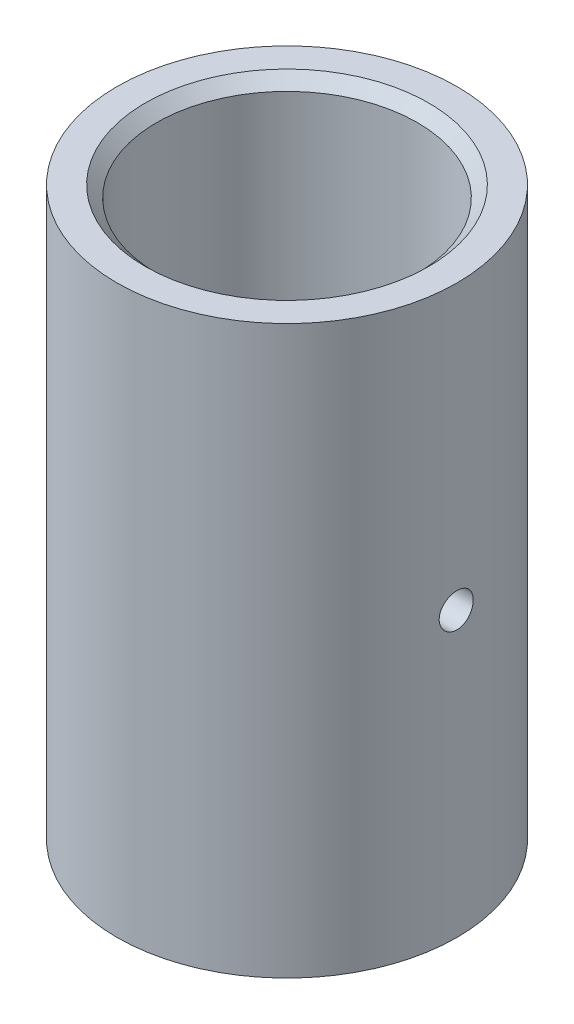
ISO-10303-21;
HEADER;
FILE_DESCRIPTION(('STEP AP214'),'2;1');
FILE_NAME('part.step','',(''),(''),'','','');
FILE_SCHEMA(('AUTOMOTIVE_DESIGN { 1 0 10303 214 1 1 1 1 }'));
ENDSEC;
DATA;
#1=APPLICATION_CONTEXT('core data for automotive mechanical design processes');
#2=APPLICATION_PROTOCOL_DEFINITION('international standard','automotive_design',2000,#1);
#3=PRODUCT_CONTEXT('',#1,'mechanical');
#4=PRODUCT('Part','Part','',(#3));
#5=PRODUCT_RELATED_PRODUCT_CATEGORY('part','',(#4));
#6=PRODUCT_DEFINITION_FORMATION('','',#4);
#7=PRODUCT_DEFINITION_CONTEXT('part definition',#1,'design');
#8=PRODUCT_DEFINITION('design','',#6,#7);
#9=PRODUCT_DEFINITION_SHAPE('','',#8);
#10=(LENGTH_UNIT() NAMED_UNIT(*) SI_UNIT(.MILLI.,.METRE.));
#11=(NAMED_UNIT(*) PLANE_ANGLE_UNIT() SI_UNIT($,.RADIAN.));
#12=(NAMED_UNIT(*) SI_UNIT($,.STERADIAN.) SOLID_ANGLE_UNIT());
#13=UNCERTAINTY_MEASURE_WITH_UNIT(LENGTH_MEASURE(1.E-05),#10,'distance_accuracy_value','');
#14=(GEOMETRIC_REPRESENTATION_CONTEXT(3) GLOBAL_UNCERTAINTY_ASSIGNED_CONTEXT((#13)) GLOBAL_UNIT_ASSIGNED_CONTEXT((#10,
#11,#12)) REPRESENTATION_CONTEXT('',''));
#15=CARTESIAN_POINT('',(0.,0.,0.));
#16=DIRECTION('',(0.,0.,1.));
#17=DIRECTION('',(1.,0.,0.));
#18=AXIS2_PLACEMENT_3D('',#15,#16,#17);
#19=CARTESIAN_POINT('',(0.,25.,0.));
#20=DIRECTION('',(0.,-1.,0.));
#21=DIRECTION('',(0.,0.,-1.));
#22=AXIS2_PLACEMENT_3D('',#19,#20,#21);
#23=CYLINDRICAL_SURFACE('',#22,7.5);
#24=CARTESIAN_POINT('',(-7.46240577829965,12.5,-0.75));
#25=CARTESIAN_POINT('',(-7.46240627097677,12.4579853268698,-0.749998180045134));
#26=CARTESIAN_POINT('',(-7.46276442745664,12.4159428736911,-0.746457644236857));
#27=CARTESIAN_POINT('',(-7.46415815668589,12.3330236102798,-0.732387236072671));
#28=CARTESIAN_POINT('',(-7.46519447595914,12.2921481364719,-0.721849661164827));
#29=CARTESIAN_POINT('',(-7.4678259978554,12.2127756355866,-0.694095087051695));
#30=CARTESIAN_POINT('',(-7.46942086160092,12.1742771829564,-0.676882137220424));
#31=CARTESIAN_POINT('',(-7.47298935428865,12.1007241557812,-0.636273200543326));
#32=CARTESIAN_POINT('',(-7.47496290798247,12.0656688991372,-0.612878441719444));
#33=CARTESIAN_POINT('',(-7.47907445032424,11.9998615522569,-0.560478571499028));
#34=CARTESIAN_POINT('',(-7.4812129500395,11.9691237428722,-0.531455563581194));
#35=CARTESIAN_POINT('',(-7.48540878926789,11.9129467932473,-0.468661286489673));
#36=CARTESIAN_POINT('',(-7.4874661250641,11.8875078954453,-0.434889800179926));
#37=CARTESIAN_POINT('',(-7.49127287366704,11.8426015572446,-0.363469771238241));
#38=CARTESIAN_POINT('',(-7.49302163170985,11.8231467509048,-0.325813246897177));
#39=CARTESIAN_POINT('',(-7.49600862656828,11.7908416751385,-0.247747488215632));
#40=CARTESIAN_POINT('',(-7.49724687582798,11.7779912447229,-0.207338321001163));
#41=CARTESIAN_POINT('',(-7.49906974928269,11.7593015679851,-0.125058587057212));
#42=CARTESIAN_POINT('',(-7.49965655882113,11.7534388754375,-0.0831933952736856));
#43=CARTESIAN_POINT('',(-7.50011786699019,11.7488185481497,0.000930555516707348));
#44=CARTESIAN_POINT('',(-7.49999238408954,11.7500607291903,0.0431893042908458));
#45=CARTESIAN_POINT('',(-7.49904503483389,11.7595958544876,0.12674163304842));
#46=CARTESIAN_POINT('',(-7.49822565863784,11.7678635866729,0.168038122451234));
#47=CARTESIAN_POINT('',(-7.49598546948698,11.79117584671,0.2486543846284));
#48=CARTESIAN_POINT('',(-7.49456464871965,11.8062204625907,0.287974131718296));
#49=CARTESIAN_POINT('',(-7.49127703112937,11.8426870724408,0.36360023600969));
#50=CARTESIAN_POINT('',(-7.48940945524318,11.8641202231476,0.399901178236238));
#51=CARTESIAN_POINT('',(-7.48543788389556,11.9127473925023,0.468400134880646));
#52=CARTESIAN_POINT('',(-7.48333388150108,11.9399415801089,0.500598028920621));
#53=CARTESIAN_POINT('',(-7.47911470100888,11.9994606721352,0.560124578867017));
#54=CARTESIAN_POINT('',(-7.47699951429771,12.0318075085562,0.587431309642758));
#55=CARTESIAN_POINT('',(-7.47300554946167,12.1006376489081,0.636230651518438));
#56=CARTESIAN_POINT('',(-7.47112677167973,12.1371209588391,0.657723254184667));
#57=CARTESIAN_POINT('',(-7.46781817135612,12.2132052688998,0.694284138429923));
#58=CARTESIAN_POINT('',(-7.46638844349416,12.2528069243172,0.70935106542972));
#59=CARTESIAN_POINT('',(-7.46414176403203,12.333995453461,0.732615551728192));
#60=CARTESIAN_POINT('',(-7.46332479376326,12.3755822666656,0.740813320307275));
#61=CARTESIAN_POINT('',(-7.46239935395563,12.4593681346471,0.75007858154397));
#62=CARTESIAN_POINT('',(-7.46228783660702,12.5015637651986,0.751176747485409));
#63=CARTESIAN_POINT('',(-7.46277788516079,12.5855384493671,0.746292185153522));
#64=CARTESIAN_POINT('',(-7.46337944142796,12.6273175086053,0.740309552557316));
#65=CARTESIAN_POINT('',(-7.46522508316801,12.7091836867088,0.72145888088064));
#66=CARTESIAN_POINT('',(-7.46646781501009,12.749274178321,0.708605345391682));
#67=CARTESIAN_POINT('',(-7.46945468279096,12.8267300387977,0.676392539756955));
#68=CARTESIAN_POINT('',(-7.47119883021502,12.8640953452154,0.657033120587692));
#69=CARTESIAN_POINT('',(-7.47499938266785,12.9351799805216,0.612281251067414));
#70=CARTESIAN_POINT('',(-7.47705683111004,12.9688864564747,0.586868474880519));
#71=CARTESIAN_POINT('',(-7.4812487446889,13.0315662899556,0.530760400088381));
#72=CARTESIAN_POINT('',(-7.48338321173149,13.0605395302551,0.500064970686101));
#73=CARTESIAN_POINT('',(-7.48749785886976,13.1130362250486,0.434129853169856));
#74=CARTESIAN_POINT('',(-7.48947745541606,13.1365396696897,0.39887419197709));
#75=CARTESIAN_POINT('',(-7.49305081579973,13.1772919013798,0.324898288062849));
#76=CARTESIAN_POINT('',(-7.49464458492369,13.1945407741303,0.28617809282222));
#77=CARTESIAN_POINT('',(-7.49726407810504,13.2222603257415,0.206442094824612));
#78=CARTESIAN_POINT('',(-7.49829081454236,13.2327430904939,0.16543052823747));
#79=CARTESIAN_POINT('',(-7.49966470960237,13.2466723021849,0.0822186104877594));
#80=CARTESIAN_POINT('',(-7.50001188732422,13.2501189468755,0.0400182927691633));
#81=CARTESIAN_POINT('',(-7.49998753734952,13.24987530017,-0.0441766680568097));
#82=CARTESIAN_POINT('',(-7.49961913782502,13.2462160723725,-0.0861714054183956));
#83=CARTESIAN_POINT('',(-7.49821120183193,13.2319296907573,-0.168946416267272));
#84=CARTESIAN_POINT('',(-7.49717166483655,13.2213025314703,-0.209726688801274));
#85=CARTESIAN_POINT('',(-7.49453792860471,13.1933905569553,-0.288914931575808));
#86=CARTESIAN_POINT('',(-7.49294380502437,13.1761066497994,-0.327323224558146));
#87=CARTESIAN_POINT('',(-7.48937859312222,13.1353751233123,-0.400698450116097));
#88=CARTESIAN_POINT('',(-7.48740750700616,13.1119275400467,-0.435665402826419));
#89=CARTESIAN_POINT('',(-7.48329888501791,13.0594177857322,-0.501324543320204));
#90=CARTESIAN_POINT('',(-7.48116068595524,13.0303324878164,-0.531998194664506));
#91=CARTESIAN_POINT('',(-7.47696443077244,12.9674184863409,-0.588043319544858));
#92=CARTESIAN_POINT('',(-7.47490639400833,12.9335886461232,-0.613413518885886));
#93=CARTESIAN_POINT('',(-7.47109787557951,12.8620517435601,-0.65818248031804));
#94=CARTESIAN_POINT('',(-7.4693481894398,12.824335039007,-0.677565890996126));
#95=CARTESIAN_POINT('',(-7.46636396071846,12.7461887815653,-0.709698531074077));
#96=CARTESIAN_POINT('',(-7.46512883740019,12.7057623470557,-0.722455243417394));
#97=CARTESIAN_POINT('',(-7.46362505653609,12.6375891943257,-0.737791266250147));
#98=CARTESIAN_POINT('',(-7.4631699895177,12.6102783115202,-0.742363284298669));
#99=CARTESIAN_POINT('',(-7.46256018883247,12.5553156327181,-0.748468243953835));
#100=CARTESIAN_POINT('',(-7.46240545390488,12.5276638381531,-0.750001198317948));
#101=CARTESIAN_POINT('',(-7.46240577829965,12.5,-0.75));
#102=B_SPLINE_CURVE_WITH_KNOTS('',3,(#24,#25,#26,#27,#28,#29,#30,#31,#32,#33,#34,#35,#36,#37,
#38,#39,#40,#41,#42,#43,#44,#45,#46,#47,#48,#49,#50,#51,#52,#53,#54,#55,#56,#57,#58,#59,#60,#61,
#62,#63,#64,#65,#66,#67,#68,#69,#70,#71,#72,#73,#74,#75,#76,#77,#78,#79,#80,#81,#82,#83,#84,#85,
#86,#87,#88,#89,#90,#91,#92,#93,#94,#95,#96,#97,#98,#99,#100,#101),.UNSPECIFIED.,.T.,.F.,(4,2,2,
2,2,2,2,2,2,2,2,2,2,2,2,2,2,2,2,2,2,2,2,2,2,2,2,2,2,2,2,2,2,2,2,2,2,2,4),(0.,0.125942995827347,
0.252024863866327,0.378030368248105,0.504010860315985,0.630398711474438,0.756792343914397,
0.883451024784688,1.01010661805846,1.13633603173837,1.26256217248674,1.38833723863996,
1.51411393860731,1.6401115909981,1.76611293913897,1.89266568813751,2.01921862070672,
2.1457982183845,2.27237395946275,2.39840247230824,2.52442928225153,2.65019111028395,
2.77595581920785,2.90214892358789,3.02834515292402,3.15499602613589,3.28164516388504,
3.40806744520771,3.53448617334862,3.66035350101362,3.78622092747494,3.91207118996435,
4.03792071608099,4.16429786278491,4.29070533775894,4.41743430802857,4.54401986170501,
4.62694520704535,4.70987020427861),.UNSPECIFIED.);
#103=CARTESIAN_POINT('',(-7.46240577829965,12.5,-0.75));
#104=VERTEX_POINT('',#103);
#105=EDGE_CURVE('E94',#104,#104,#102,.T.);
#106=ORIENTED_EDGE('',*,*,#105,.F.);
#107=EDGE_LOOP('',(#106));
#108=FACE_BOUND('',#107,.T.);
#109=CARTESIAN_POINT('',(0.,0.,0.));
#110=DIRECTION('',(0.,1.,0.));
#111=DIRECTION('',(0.,0.,1.));
#112=AXIS2_PLACEMENT_3D('',#109,#110,#111);
#113=CIRCLE('',#112,7.5);
#114=CARTESIAN_POINT('',(0.,0.,7.5));
#115=VERTEX_POINT('',#114);
#116=EDGE_CURVE('E47',#115,#115,#113,.T.);
#117=ORIENTED_EDGE('',*,*,#116,.T.);
#118=EDGE_LOOP('',(#117));
#119=FACE_BOUND('',#118,.T.);
#120=CARTESIAN_POINT('',(0.,25.,0.));
#121=DIRECTION('',(0.,1.,0.));
#122=DIRECTION('',(0.,0.,1.));
#123=AXIS2_PLACEMENT_3D('',#120,#121,#122);
#124=CIRCLE('',#123,7.5);
#125=CARTESIAN_POINT('',(0.,25.,7.5));
#126=VERTEX_POINT('',#125);
#127=EDGE_CURVE('E43',#126,#126,#124,.T.);
#128=ORIENTED_EDGE('',*,*,#127,.F.);
#129=EDGE_LOOP('',(#128));
#130=FACE_BOUND('',#129,.T.);
#131=CARTESIAN_POINT('',(7.46240577829965,12.5,0.75));
#132=CARTESIAN_POINT('',(7.46240627097677,12.5420146731302,0.749998180045134));
#133=CARTESIAN_POINT('',(7.46276442745664,12.5840571263089,0.746457644236856));
#134=CARTESIAN_POINT('',(7.46415815668589,12.6669763897202,0.732387236072671));
#135=CARTESIAN_POINT('',(7.46519447595914,12.7078518635281,0.721849661164827));
#136=CARTESIAN_POINT('',(7.4678259978554,12.7872243644134,0.694095087051695));
#137=CARTESIAN_POINT('',(7.46942086160092,12.8257228170436,0.676882137220424));
#138=CARTESIAN_POINT('',(7.47298935428865,12.8992758442188,0.636273200543326));
#139=CARTESIAN_POINT('',(7.47496290798247,12.9343311008628,0.612878441719444));
#140=CARTESIAN_POINT('',(7.47907445032424,13.0001384477431,0.560478571499028));
#141=CARTESIAN_POINT('',(7.4812129500395,13.0308762571278,0.531455563581194));
#142=CARTESIAN_POINT('',(7.48540878926789,13.0870532067527,0.468661286489673));
#143=CARTESIAN_POINT('',(7.4874661250641,13.1124921045547,0.434889800179927));
#144=CARTESIAN_POINT('',(7.49127287366704,13.1573984427554,0.363469771238241));
#145=CARTESIAN_POINT('',(7.49302163170985,13.1768532490952,0.325813246897177));
#146=CARTESIAN_POINT('',(7.49600862656828,13.2091583248615,0.247747488215633));
#147=CARTESIAN_POINT('',(7.49724687582798,13.2220087552771,0.207338321001164));
#148=CARTESIAN_POINT('',(7.49906974928269,13.2406984320149,0.125058587057212));
#149=CARTESIAN_POINT('',(7.49965655882113,13.2465611245625,0.0831933952736857));
#150=CARTESIAN_POINT('',(7.50011786699019,13.2511814518503,-0.000930555516707375));
#151=CARTESIAN_POINT('',(7.49999238408954,13.2499392708097,-0.0431893042908458));
#152=CARTESIAN_POINT('',(7.49904503483389,13.2404041455124,-0.12674163304842));
#153=CARTESIAN_POINT('',(7.49822565863784,13.2321364133271,-0.168038122451234));
#154=CARTESIAN_POINT('',(7.49598546948698,13.20882415329,-0.2486543846284));
#155=CARTESIAN_POINT('',(7.49456464871965,13.1937795374093,-0.287974131718296));
#156=CARTESIAN_POINT('',(7.49127703112937,13.1573129275592,-0.36360023600969));
#157=CARTESIAN_POINT('',(7.48940945524318,13.1358797768524,-0.399901178236238));
#158=CARTESIAN_POINT('',(7.48543788389556,13.0872526074977,-0.468400134880646));
#159=CARTESIAN_POINT('',(7.48333388150108,13.0600584198911,-0.500598028920621));
#160=CARTESIAN_POINT('',(7.47911470100888,13.0005393278648,-0.560124578867017));
#161=CARTESIAN_POINT('',(7.47699951429771,12.9681924914438,-0.587431309642758));
#162=CARTESIAN_POINT('',(7.47300554946167,12.8993623510919,-0.636230651518438));
#163=CARTESIAN_POINT('',(7.47112677167973,12.8628790411609,-0.657723254184667));
#164=CARTESIAN_POINT('',(7.46781817135612,12.7867947311002,-0.694284138429923));
#165=CARTESIAN_POINT('',(7.46638844349416,12.7471930756828,-0.70935106542972));
#166=CARTESIAN_POINT('',(7.46414176403203,12.666004546539,-0.732615551728192));
#167=CARTESIAN_POINT('',(7.46332479376326,12.6244177333344,-0.740813320307275));
#168=CARTESIAN_POINT('',(7.46239935395563,12.5406318653529,-0.75007858154397));
#169=CARTESIAN_POINT('',(7.46228783660702,12.4984362348014,-0.751176747485409));
#170=CARTESIAN_POINT('',(7.46277788516079,12.4144615506329,-0.746292185153522));
#171=CARTESIAN_POINT('',(7.46337944142796,12.3726824913947,-0.740309552557316));
#172=CARTESIAN_POINT('',(7.46522508316801,12.2908163132912,-0.72145888088064));
#173=CARTESIAN_POINT('',(7.46646781501009,12.250725821679,-0.708605345391682));
#174=CARTESIAN_POINT('',(7.46945468279096,12.1732699612023,-0.676392539756955));
#175=CARTESIAN_POINT('',(7.47119883021502,12.1359046547846,-0.657033120587692));
#176=CARTESIAN_POINT('',(7.47499938266785,12.0648200194784,-0.612281251067414));
#177=CARTESIAN_POINT('',(7.47705683111004,12.0311135435253,-0.586868474880519));
#178=CARTESIAN_POINT('',(7.4812487446889,11.9684337100445,-0.530760400088381));
#179=CARTESIAN_POINT('',(7.48338321173149,11.9394604697449,-0.500064970686101));
#180=CARTESIAN_POINT('',(7.48749785886976,11.8869637749514,-0.434129853169856));
#181=CARTESIAN_POINT('',(7.48947745541606,11.8634603303103,-0.39887419197709));
#182=CARTESIAN_POINT('',(7.49305081579973,11.8227080986202,-0.32489828806285));
#183=CARTESIAN_POINT('',(7.49464458492369,11.8054592258697,-0.28617809282222));
#184=CARTESIAN_POINT('',(7.49726407810504,11.7777396742585,-0.206442094824612));
#185=CARTESIAN_POINT('',(7.49829081454236,11.7672569095061,-0.16543052823747));
#186=CARTESIAN_POINT('',(7.49966470960237,11.7533276978151,-0.0822186104877594));
#187=CARTESIAN_POINT('',(7.50001188732422,11.7498810531245,-0.0400182927691633));
#188=CARTESIAN_POINT('',(7.49998753734952,11.75012469983,0.0441766680568097));
#189=CARTESIAN_POINT('',(7.49961913782502,11.7537839276275,0.0861714054183956));
#190=CARTESIAN_POINT('',(7.49821120183193,11.7680703092427,0.168946416267272));
#191=CARTESIAN_POINT('',(7.49717166483655,11.7786974685297,0.209726688801274));
#192=CARTESIAN_POINT('',(7.49453792860471,11.8066094430447,0.288914931575808));
#193=CARTESIAN_POINT('',(7.49294380502437,11.8238933502006,0.327323224558146));
#194=CARTESIAN_POINT('',(7.48937859312222,11.8646248766877,0.400698450116097));
#195=CARTESIAN_POINT('',(7.48740750700616,11.8880724599533,0.435665402826419));
#196=CARTESIAN_POINT('',(7.48329888501791,11.9405822142678,0.501324543320204));
#197=CARTESIAN_POINT('',(7.48116068595524,11.9696675121836,0.531998194664506));
#198=CARTESIAN_POINT('',(7.47696443077244,12.0325815136591,0.588043319544858));
#199=CARTESIAN_POINT('',(7.47490639400833,12.0664113538768,0.613413518885886));
#200=CARTESIAN_POINT('',(7.47109787557951,12.1379482564399,0.65818248031804));
#201=CARTESIAN_POINT('',(7.4693481894398,12.175664960993,0.677565890996126));
#202=CARTESIAN_POINT('',(7.46636396071846,12.2538112184347,0.709698531074077));
#203=CARTESIAN_POINT('',(7.46512883740019,12.2942376529443,0.722455243417394));
#204=CARTESIAN_POINT('',(7.46362505653609,12.3624108056743,0.737791266250147));
#205=CARTESIAN_POINT('',(7.4631699895177,12.3897216884798,0.742363284298669));
#206=CARTESIAN_POINT('',(7.46256018883247,12.4446843672819,0.748468243953835));
#207=CARTESIAN_POINT('',(7.46240545390488,12.4723361618469,0.750001198317948));
#208=CARTESIAN_POINT('',(7.46240577829965,12.5,0.75));
#209=B_SPLINE_CURVE_WITH_KNOTS('',3,(#131,#132,#133,#134,#135,#136,#137,#138,#139,#140,#141,
#142,#143,#144,#145,#146,#147,#148,#149,#150,#151,#152,#153,#154,#155,#156,#157,#158,#159,#160,
#161,#162,#163,#164,#165,#166,#167,#168,#169,#170,#171,#172,#173,#174,#175,#176,#177,#178,#179,
#180,#181,#182,#183,#184,#185,#186,#187,#188,#189,#190,#191,#192,#193,#194,#195,#196,#197,#198,
#199,#200,#201,#202,#203,#204,#205,#206,#207,#208),.UNSPECIFIED.,.T.,.F.,(4,2,2,2,2,2,2,2,2,2,2,
2,2,2,2,2,2,2,2,2,2,2,2,2,2,2,2,2,2,2,2,2,2,2,2,2,2,2,4),(0.,0.125942995827346,
0.252024863866327,0.378030368248104,0.504010860315985,0.630398711474438,0.756792343914397,
0.883451024784687,1.01010661805846,1.13633603173837,1.26256217248674,1.38833723863996,
1.51411393860731,1.6401115909981,1.76611293913897,1.89266568813751,2.01921862070672,
2.1457982183845,2.27237395946275,2.39840247230824,2.52442928225153,2.65019111028395,
2.77595581920785,2.90214892358789,3.02834515292402,3.15499602613589,3.28164516388504,
3.40806744520771,3.53448617334862,3.66035350101362,3.78622092747494,3.91207118996435,
4.03792071608099,4.16429786278491,4.29070533775894,4.41743430802857,4.54401986170501,
4.62694520704535,4.70987020427861),.UNSPECIFIED.);
#210=CARTESIAN_POINT('',(7.46240577829965,12.5,0.75));
#211=VERTEX_POINT('',#210);
#212=EDGE_CURVE('E59',#211,#211,#209,.T.);
#213=ORIENTED_EDGE('',*,*,#212,.T.);
#214=EDGE_LOOP('',(#213));
#215=FACE_BOUND('',#214,.T.);
#216=ADVANCED_FACE('F32',(#108,#119,#130,#215),#23,.T.);
#217=CARTESIAN_POINT('',(0.,4.,0.));
#218=DIRECTION('',(0.,1.,0.));
#219=DIRECTION('',(0.,0.,1.));
#220=AXIS2_PLACEMENT_3D('',#217,#218,#219);
#221=CYLINDRICAL_SURFACE('',#220,3.5);
#222=CARTESIAN_POINT('',(-3.41869858279434,12.5,-0.75));
#223=CARTESIAN_POINT('',(-3.41869942294351,12.5416055762336,-0.749998541194088));
#224=CARTESIAN_POINT('',(-3.41946636233665,12.5832288869482,-0.746526181228762));
#225=CARTESIAN_POINT('',(-3.42244589278789,12.6652933360997,-0.732742796269729));
#226=CARTESIAN_POINT('',(-3.42465955623036,12.7057335743339,-0.722426698268708));
#227=CARTESIAN_POINT('',(-3.43027057629631,12.7842328747946,-0.695294318421272));
#228=CARTESIAN_POINT('',(-3.43366666358336,12.8222944390627,-0.67848500495611));
#229=CARTESIAN_POINT('',(-3.44125835428899,12.8950576369703,-0.638863088367167));
#230=CARTESIAN_POINT('',(-3.44545393440007,12.929759368514,-0.616050660244004));
#231=CARTESIAN_POINT('',(-3.45424789397074,12.9953814807416,-0.564675712850978));
#232=CARTESIAN_POINT('',(-3.45885124935541,13.0262394381201,-0.536034297419881));
#233=CARTESIAN_POINT('',(-3.46789845855534,13.0827517772027,-0.473984754064823));
#234=CARTESIAN_POINT('',(-3.47234230025799,13.10840576443,-0.440576265108847));
#235=CARTESIAN_POINT('',(-3.48062384554625,13.1540277222458,-0.369523644232282));
#236=CARTESIAN_POINT('',(-3.4844549940969,13.1739358278853,-0.331840244114974));
#237=CARTESIAN_POINT('',(-3.49102335521491,13.2071138457231,-0.253567134671299));
#238=CARTESIAN_POINT('',(-3.49376068551671,13.2203844723931,-0.212977738690156));
#239=CARTESIAN_POINT('',(-3.49779782640584,13.2397149854657,-0.130693593835755));
#240=CARTESIAN_POINT('',(-3.49911866689191,13.2458804642762,-0.0890247002984609));
#241=CARTESIAN_POINT('',(-3.50024681103503,13.2511556386566,-0.00522447265332215));
#242=CARTESIAN_POINT('',(-3.5000542811635,13.2502661102804,0.0369068100823797));
#243=CARTESIAN_POINT('',(-3.49819350431279,13.2415355176682,0.119708514625256));
#244=CARTESIAN_POINT('',(-3.49654941576216,13.233808249855,0.160391557681056));
#245=CARTESIAN_POINT('',(-3.49199770794552,13.2118026590741,0.239869731989194));
#246=CARTESIAN_POINT('',(-3.48909003308259,13.1975240478501,0.278664780087526));
#247=CARTESIAN_POINT('',(-3.48229877323429,13.1627192705557,0.353583748778276));
#248=CARTESIAN_POINT('',(-3.47840842901973,13.1421496163978,0.389686828507895));
#249=CARTESIAN_POINT('',(-3.47007896871933,13.0953790159182,0.457970463281424));
#250=CARTESIAN_POINT('',(-3.46563978072347,13.0691773313499,0.490150503225764));
#251=CARTESIAN_POINT('',(-3.45659663230462,13.0112657277361,0.55035104400099));
#252=CARTESIAN_POINT('',(-3.45199115186426,12.9794562103215,0.578275586601253));
#253=CARTESIAN_POINT('',(-3.44321783415987,12.9115583574657,0.62841121617364));
#254=CARTESIAN_POINT('',(-3.43905000781693,12.8754699152974,0.650622160590341));
#255=CARTESIAN_POINT('',(-3.43162011793361,12.7998877494681,0.688740387866483));
#256=CARTESIAN_POINT('',(-3.42836057563888,12.7603849380738,0.704630175444614));
#257=CARTESIAN_POINT('',(-3.42315170403308,12.6791836170268,0.729517475795578));
#258=CARTESIAN_POINT('',(-3.42120217609241,12.6374854412784,0.738516033473139));
#259=CARTESIAN_POINT('',(-3.41887440627723,12.5539521236751,0.74921793012326));
#260=CARTESIAN_POINT('',(-3.41846613525851,12.5121356624613,0.751060709643201));
#261=CARTESIAN_POINT('',(-3.41918619786997,12.4287930034092,0.747775698211867));
#262=CARTESIAN_POINT('',(-3.42031443050531,12.3872667866732,0.742648365408176));
#263=CARTESIAN_POINT('',(-3.42395207742103,12.3061647825096,0.725689473177921));
#264=CARTESIAN_POINT('',(-3.42644577637182,12.2665722837015,0.713934151257768));
#265=CARTESIAN_POINT('',(-3.43251929934889,12.1899188312335,0.684135264733748));
#266=CARTESIAN_POINT('',(-3.43609922386425,12.1528581121829,0.666091118314091));
#267=CARTESIAN_POINT('',(-3.44400817040173,12.0817151576205,0.623917522083524));
#268=CARTESIAN_POINT('',(-3.44834750873158,12.0476852089939,0.59970184295396));
#269=CARTESIAN_POINT('',(-3.4572588768007,11.9841208270631,0.545985919168002));
#270=CARTESIAN_POINT('',(-3.46183093417231,11.9545869292758,0.516485045910805));
#271=CARTESIAN_POINT('',(-3.47079119995087,11.9003148485276,0.452406382210407));
#272=CARTESIAN_POINT('',(-3.47517467803873,11.8756715419215,0.417747462914385));
#273=CARTESIAN_POINT('',(-3.48317805357451,11.8325572953245,0.344700740641138));
#274=CARTESIAN_POINT('',(-3.48679798588346,11.8140860735136,0.30631310802187));
#275=CARTESIAN_POINT('',(-3.49284639190787,11.7839739726808,0.22713270949102));
#276=CARTESIAN_POINT('',(-3.49528221901849,11.7722908481269,0.186356596537586));
#277=CARTESIAN_POINT('',(-3.4987196965099,11.7559541471338,0.103362588501645));
#278=CARTESIAN_POINT('',(-3.49972154656148,11.751299592013,0.0611448949869967));
#279=CARTESIAN_POINT('',(-3.50017255504528,11.7491946737941,-0.0226318585264144));
#280=CARTESIAN_POINT('',(-3.49965229500834,11.7516024206977,-0.0641872527546144));
#281=CARTESIAN_POINT('',(-3.49718276181691,11.7632373817595,-0.14628646920798));
#282=CARTESIAN_POINT('',(-3.49523351236842,11.7724644827892,-0.186830308202642));
#283=CARTESIAN_POINT('',(-3.49012694319269,11.7974094031247,-0.265650974243634));
#284=CARTESIAN_POINT('',(-3.48697323215248,11.8131078446928,-0.303934182536588));
#285=CARTESIAN_POINT('',(-3.47979518025329,11.8505306355846,-0.377342478361609));
#286=CARTESIAN_POINT('',(-3.47577075860164,11.872255544153,-0.41246727239807));
#287=CARTESIAN_POINT('',(-3.46719904967253,11.9215811593713,-0.479256153447622));
#288=CARTESIAN_POINT('',(-3.4626435445396,11.9492820791606,-0.510845182552889));
#289=CARTESIAN_POINT('',(-3.45356845037895,12.0095703051252,-0.568975007288211));
#290=CARTESIAN_POINT('',(-3.44904887022754,12.0421587816778,-0.595514590312102));
#291=CARTESIAN_POINT('',(-3.44049346826046,12.1117952465928,-0.643116307983381));
#292=CARTESIAN_POINT('',(-3.43646452978599,12.1488946791434,-0.664104489048105));
#293=CARTESIAN_POINT('',(-3.42943248613692,12.2261718604617,-0.699515023299101));
#294=CARTESIAN_POINT('',(-3.42642849789546,12.2663469226268,-0.713943032119568));
#295=CARTESIAN_POINT('',(-3.42235280321944,12.3388130655927,-0.733193035607852));
#296=CARTESIAN_POINT('',(-3.42099141547116,12.3707058378531,-0.739483762538932));
#297=CARTESIAN_POINT('',(-3.41916399749064,12.4350621557894,-0.74788772021697));
#298=CARTESIAN_POINT('',(-3.41869792703424,12.467525675757,-0.750001138639108));
#299=CARTESIAN_POINT('',(-3.41869858279434,12.5,-0.75));
#300=B_SPLINE_CURVE_WITH_KNOTS('',3,(#222,#223,#224,#225,#226,#227,#228,#229,#230,#231,#232,
#233,#234,#235,#236,#237,#238,#239,#240,#241,#242,#243,#244,#245,#246,#247,#248,#249,#250,#251,
#252,#253,#254,#255,#256,#257,#258,#259,#260,#261,#262,#263,#264,#265,#266,#267,#268,#269,#270,
#271,#272,#273,#274,#275,#276,#277,#278,#279,#280,#281,#282,#283,#284,#285,#286,#287,#288,#289,
#290,#291,#292,#293,#294,#295,#296,#297,#298,#299),.UNSPECIFIED.,.T.,.F.,(4,2,2,2,2,2,2,2,2,2,2,
2,2,2,2,2,2,2,2,2,2,2,2,2,2,2,2,2,2,2,2,2,2,2,2,2,2,2,4),(0.,0.124697741002726,
0.249488019218576,0.374144745554973,0.498797838346235,0.625266147892055,0.751744040542987,
0.879495674079986,1.00723355320993,1.13304754073824,1.2588476888648,1.38259278831545,
1.50634333301651,1.63096944069578,1.75561189434017,1.88274480387507,2.00988088509405,
2.1373664370375,2.26483265474779,2.38980216594121,2.51476346324818,2.63831590372547,
2.76187977779435,2.88727505106019,3.01268524827398,3.14033107339465,3.2679710693563,
3.39480794910047,3.52162716602129,3.64591599819923,3.77020276855409,3.89412004807601,
4.01804883073542,4.14424457078342,4.27047057813476,4.39830190081484,4.52602280803703,
4.62335728058995,4.72068738006871),.UNSPECIFIED.);
#301=CARTESIAN_POINT('',(-3.41869858279434,12.5,-0.75));
#302=VERTEX_POINT('',#301);
#303=EDGE_CURVE('E90',#302,#302,#300,.T.);
#304=ORIENTED_EDGE('',*,*,#303,.F.);
#305=EDGE_LOOP('',(#304));
#306=FACE_BOUND('',#305,.T.);
#307=CARTESIAN_POINT('',(0.,14.,0.));
#308=DIRECTION('',(0.,1.,0.));
#309=DIRECTION('',(0.,0.,1.));
#310=AXIS2_PLACEMENT_3D('',#307,#308,#309);
#311=CIRCLE('',#310,3.5);
#312=CARTESIAN_POINT('',(0.,14.,3.5));
#313=VERTEX_POINT('',#312);
#314=EDGE_CURVE('E56',#313,#313,#311,.T.);
#315=ORIENTED_EDGE('',*,*,#314,.T.);
#316=EDGE_LOOP('',(#315));
#317=FACE_BOUND('',#316,.T.);
#318=CARTESIAN_POINT('',(0.,4.,0.));
#319=DIRECTION('',(0.,1.,0.));
#320=DIRECTION('',(0.,0.,1.));
#321=AXIS2_PLACEMENT_3D('',#318,#319,#320);
#322=CIRCLE('',#321,3.5);
#323=CARTESIAN_POINT('',(0.,4.,3.5));
#324=VERTEX_POINT('',#323);
#325=EDGE_CURVE('E55',#324,#324,#322,.T.);
#326=ORIENTED_EDGE('',*,*,#325,.F.);
#327=EDGE_LOOP('',(#326));
#328=FACE_BOUND('',#327,.T.);
#329=CARTESIAN_POINT('',(3.41869858279434,12.5,0.75));
#330=CARTESIAN_POINT('',(3.41869942294351,12.4583944237664,0.749998541194088));
#331=CARTESIAN_POINT('',(3.41946636233665,12.4167711130518,0.746526181228762));
#332=CARTESIAN_POINT('',(3.42244589278789,12.3347066639003,0.732742796269729));
#333=CARTESIAN_POINT('',(3.42465955623036,12.2942664256661,0.722426698268708));
#334=CARTESIAN_POINT('',(3.43027057629631,12.2157671252054,0.695294318421272));
#335=CARTESIAN_POINT('',(3.43366666358336,12.1777055609373,0.67848500495611));
#336=CARTESIAN_POINT('',(3.44125835428899,12.1049423630297,0.638863088367167));
#337=CARTESIAN_POINT('',(3.44545393440007,12.070240631486,0.616050660244004));
#338=CARTESIAN_POINT('',(3.45424789397074,12.0046185192584,0.564675712850978));
#339=CARTESIAN_POINT('',(3.45885124935541,11.9737605618799,0.536034297419881));
#340=CARTESIAN_POINT('',(3.46789845855534,11.9172482227973,0.473984754064823));
#341=CARTESIAN_POINT('',(3.47234230025799,11.89159423557,0.440576265108847));
#342=CARTESIAN_POINT('',(3.48062384554625,11.8459722777542,0.369523644232282));
#343=CARTESIAN_POINT('',(3.4844549940969,11.8260641721147,0.331840244114974));
#344=CARTESIAN_POINT('',(3.49102335521491,11.7928861542769,0.2535671346713));
#345=CARTESIAN_POINT('',(3.49376068551671,11.7796155276069,0.212977738690156));
#346=CARTESIAN_POINT('',(3.49779782640584,11.7602850145343,0.130693593835754));
#347=CARTESIAN_POINT('',(3.49911866689191,11.7541195357238,0.0890247002984609));
#348=CARTESIAN_POINT('',(3.50024681103503,11.7488443613434,0.00522447265332214));
#349=CARTESIAN_POINT('',(3.5000542811635,11.7497338897196,-0.0369068100823797));
#350=CARTESIAN_POINT('',(3.49819350431279,11.7584644823318,-0.119708514625256));
#351=CARTESIAN_POINT('',(3.49654941576216,11.766191750145,-0.160391557681056));
#352=CARTESIAN_POINT('',(3.49199770794552,11.7881973409259,-0.239869731989194));
#353=CARTESIAN_POINT('',(3.48909003308259,11.8024759521499,-0.278664780087527));
#354=CARTESIAN_POINT('',(3.48229877323429,11.8372807294443,-0.353583748778276));
#355=CARTESIAN_POINT('',(3.47840842901973,11.8578503836022,-0.389686828507894));
#356=CARTESIAN_POINT('',(3.47007896871933,11.9046209840818,-0.457970463281423));
#357=CARTESIAN_POINT('',(3.46563978072347,11.9308226686502,-0.490150503225764));
#358=CARTESIAN_POINT('',(3.45659663230462,11.9887342722639,-0.55035104400099));
#359=CARTESIAN_POINT('',(3.45199115186426,12.0205437896785,-0.578275586601253));
#360=CARTESIAN_POINT('',(3.44321783415987,12.0884416425343,-0.62841121617364));
#361=CARTESIAN_POINT('',(3.43905000781693,12.1245300847026,-0.650622160590341));
#362=CARTESIAN_POINT('',(3.43162011793361,12.2001122505319,-0.688740387866483));
#363=CARTESIAN_POINT('',(3.42836057563888,12.2396150619262,-0.704630175444614));
#364=CARTESIAN_POINT('',(3.42315170403308,12.3208163829732,-0.729517475795578));
#365=CARTESIAN_POINT('',(3.42120217609241,12.3625145587216,-0.738516033473139));
#366=CARTESIAN_POINT('',(3.41887440627723,12.4460478763249,-0.74921793012326));
#367=CARTESIAN_POINT('',(3.41846613525851,12.4878643375387,-0.751060709643201));
#368=CARTESIAN_POINT('',(3.41918619786997,12.5712069965908,-0.747775698211867));
#369=CARTESIAN_POINT('',(3.42031443050531,12.6127332133268,-0.742648365408176));
#370=CARTESIAN_POINT('',(3.42395207742103,12.6938352174904,-0.725689473177921));
#371=CARTESIAN_POINT('',(3.42644577637182,12.7334277162985,-0.713934151257768));
#372=CARTESIAN_POINT('',(3.43251929934888,12.8100811687665,-0.684135264733748));
#373=CARTESIAN_POINT('',(3.43609922386425,12.8471418878171,-0.666091118314091));
#374=CARTESIAN_POINT('',(3.44400817040173,12.9182848423795,-0.623917522083524));
#375=CARTESIAN_POINT('',(3.44834750873158,12.9523147910061,-0.59970184295396));
#376=CARTESIAN_POINT('',(3.4572588768007,13.0158791729369,-0.545985919168002));
#377=CARTESIAN_POINT('',(3.46183093417231,13.0454130707242,-0.516485045910805));
#378=CARTESIAN_POINT('',(3.47079119995087,13.0996851514724,-0.452406382210407));
#379=CARTESIAN_POINT('',(3.47517467803873,13.1243284580785,-0.417747462914385));
#380=CARTESIAN_POINT('',(3.48317805357451,13.1674427046755,-0.344700740641138));
#381=CARTESIAN_POINT('',(3.48679798588346,13.1859139264864,-0.306313108021869));
#382=CARTESIAN_POINT('',(3.49284639190787,13.2160260273192,-0.22713270949102));
#383=CARTESIAN_POINT('',(3.49528221901849,13.2277091518731,-0.186356596537586));
#384=CARTESIAN_POINT('',(3.4987196965099,13.2440458528662,-0.103362588501645));
#385=CARTESIAN_POINT('',(3.49972154656148,13.248700407987,-0.0611448949869965));
#386=CARTESIAN_POINT('',(3.50017255504528,13.2508053262059,0.0226318585264144));
#387=CARTESIAN_POINT('',(3.49965229500834,13.2483975793023,0.0641872527546145));
#388=CARTESIAN_POINT('',(3.49718276181691,13.2367626182405,0.14628646920798));
#389=CARTESIAN_POINT('',(3.49523351236842,13.2275355172108,0.186830308202642));
#390=CARTESIAN_POINT('',(3.49012694319269,13.2025905968753,0.265650974243634));
#391=CARTESIAN_POINT('',(3.48697323215248,13.1868921553072,0.303934182536588));
#392=CARTESIAN_POINT('',(3.47979518025329,13.1494693644154,0.377342478361609));
#393=CARTESIAN_POINT('',(3.47577075860164,13.127744455847,0.41246727239807));
#394=CARTESIAN_POINT('',(3.46719904967253,13.0784188406287,0.479256153447622));
#395=CARTESIAN_POINT('',(3.4626435445396,13.0507179208394,0.510845182552889));
#396=CARTESIAN_POINT('',(3.45356845037895,12.9904296948748,0.568975007288211));
#397=CARTESIAN_POINT('',(3.44904887022754,12.9578412183222,0.595514590312102));
#398=CARTESIAN_POINT('',(3.44049346826046,12.8882047534072,0.64311630798338));
#399=CARTESIAN_POINT('',(3.436464529786,12.8511053208566,0.664104489048104));
#400=CARTESIAN_POINT('',(3.42943248613692,12.7738281395383,0.6995150232991));
#401=CARTESIAN_POINT('',(3.42642849789546,12.7336530773732,0.713943032119567));
#402=CARTESIAN_POINT('',(3.42235280321944,12.6611869344073,0.733193035607852));
#403=CARTESIAN_POINT('',(3.42099141547116,12.6292941621469,0.739483762538932));
#404=CARTESIAN_POINT('',(3.41916399749064,12.5649378442106,0.74788772021697));
#405=CARTESIAN_POINT('',(3.41869792703424,12.532474324243,0.750001138639108));
#406=CARTESIAN_POINT('',(3.41869858279434,12.5,0.75));
#407=B_SPLINE_CURVE_WITH_KNOTS('',3,(#329,#330,#331,#332,#333,#334,#335,#336,#337,#338,#339,
#340,#341,#342,#343,#344,#345,#346,#347,#348,#349,#350,#351,#352,#353,#354,#355,#356,#357,#358,
#359,#360,#361,#362,#363,#364,#365,#366,#367,#368,#369,#370,#371,#372,#373,#374,#375,#376,#377,
#378,#379,#380,#381,#382,#383,#384,#385,#386,#387,#388,#389,#390,#391,#392,#393,#394,#395,#396,
#397,#398,#399,#400,#401,#402,#403,#404,#405,#406),.UNSPECIFIED.,.T.,.F.,(4,2,2,2,2,2,2,2,2,2,2,
2,2,2,2,2,2,2,2,2,2,2,2,2,2,2,2,2,2,2,2,2,2,2,2,2,2,2,4),(0.,0.124697741002726,
0.249488019218576,0.374144745554973,0.498797838346235,0.625266147892055,0.751744040542987,
0.879495674079986,1.00723355320993,1.13304754073824,1.2588476888648,1.38259278831545,
1.50634333301651,1.63096944069578,1.75561189434017,1.88274480387507,2.00988088509405,
2.1373664370375,2.26483265474779,2.38980216594121,2.51476346324818,2.63831590372547,
2.76187977779434,2.88727505106019,3.01268524827398,3.14033107339465,3.2679710693563,
3.39480794910047,3.52162716602129,3.64591599819923,3.77020276855409,3.89412004807601,
4.01804883073542,4.14424457078342,4.27047057813476,4.39830190081484,4.52602280803703,
4.62335728058995,4.72068738006871),.UNSPECIFIED.);
#408=CARTESIAN_POINT('',(3.41869858279434,12.5,0.75));
#409=VERTEX_POINT('',#408);
#410=EDGE_CURVE('E69',#409,#409,#407,.T.);
#411=ORIENTED_EDGE('',*,*,#410,.T.);
#412=EDGE_LOOP('',(#411));
#413=FACE_BOUND('',#412,.T.);
#414=ADVANCED_FACE('F105',(#306,#317,#328,#413),#221,.F.);
#415=CARTESIAN_POINT('',(0.,25.,0.));
#416=DIRECTION('',(0.,1.,0.));
#417=DIRECTION('',(0.,0.,1.));
#418=AXIS2_PLACEMENT_3D('',#415,#416,#417);
#419=PLANE('',#418);
#420=CARTESIAN_POINT('',(0.,25.,0.));
#421=DIRECTION('',(0.,1.,0.));
#422=DIRECTION('',(0.,0.,1.));
#423=AXIS2_PLACEMENT_3D('',#420,#421,#422);
#424=CIRCLE('',#423,6.25000000000001);
#425=CARTESIAN_POINT('',(0.,25.,6.25000000000001));
#426=VERTEX_POINT('',#425);
#427=EDGE_CURVE('E10',#426,#426,#424,.F.);
#428=ORIENTED_EDGE('',*,*,#427,.T.);
#429=EDGE_LOOP('',(#428));
#430=FACE_BOUND('',#429,.T.);
#431=ORIENTED_EDGE('',*,*,#127,.T.);
#432=EDGE_LOOP('',(#431));
#433=FACE_BOUND('',#432,.T.);
#434=ADVANCED_FACE('F108',(#430,#433),#419,.T.);
#435=CARTESIAN_POINT('',(0.,0.,0.));
#436=DIRECTION('',(0.,1.,0.));
#437=DIRECTION('',(0.,0.,1.));
#438=AXIS2_PLACEMENT_3D('',#435,#436,#437);
#439=PLANE('',#438);
#440=ORIENTED_EDGE('',*,*,#116,.F.);
#441=EDGE_LOOP('',(#440));
#442=FACE_BOUND('',#441,.T.);
#443=ADVANCED_FACE('F127',(#442),#439,.F.);
#444=CARTESIAN_POINT('',(0.,14.,0.));
#445=DIRECTION('',(0.,1.,0.));
#446=DIRECTION('',(0.,0.,1.));
#447=AXIS2_PLACEMENT_3D('',#444,#445,#446);
#448=CYLINDRICAL_SURFACE('',#447,5.75);
#449=CARTESIAN_POINT('',(0.,24.5,0.));
#450=DIRECTION('',(0.,1.,0.));
#451=DIRECTION('',(0.,0.,1.));
#452=AXIS2_PLACEMENT_3D('',#449,#450,#451);
#453=CIRCLE('',#452,5.75);
#454=CARTESIAN_POINT('',(0.,24.5,5.75));
#455=VERTEX_POINT('',#454);
#456=EDGE_CURVE('E39',#455,#455,#453,.T.);
#457=ORIENTED_EDGE('',*,*,#456,.T.);
#458=EDGE_LOOP('',(#457));
#459=FACE_BOUND('',#458,.T.);
#460=CARTESIAN_POINT('',(0.,14.,0.));
#461=DIRECTION('',(0.,1.,0.));
#462=DIRECTION('',(0.,0.,1.));
#463=AXIS2_PLACEMENT_3D('',#460,#461,#462);
#464=CIRCLE('',#463,5.75);
#465=CARTESIAN_POINT('',(0.,14.,5.75));
#466=VERTEX_POINT('',#465);
#467=EDGE_CURVE('E51',#466,#466,#464,.T.);
#468=ORIENTED_EDGE('',*,*,#467,.F.);
#469=EDGE_LOOP('',(#468));
#470=FACE_BOUND('',#469,.T.);
#471=ADVANCED_FACE('F130',(#459,#470),#448,.F.);
#472=CARTESIAN_POINT('',(0.,14.,0.));
#473=DIRECTION('',(0.,1.,0.));
#474=DIRECTION('',(0.,0.,1.));
#475=AXIS2_PLACEMENT_3D('',#472,#473,#474);
#476=PLANE('',#475);
#477=ORIENTED_EDGE('',*,*,#314,.F.);
#478=EDGE_LOOP('',(#477));
#479=FACE_BOUND('',#478,.T.);
#480=ORIENTED_EDGE('',*,*,#467,.T.);
#481=EDGE_LOOP('',(#480));
#482=FACE_BOUND('',#481,.T.);
#483=ADVANCED_FACE('F136',(#479,#482),#476,.T.);
#484=CARTESIAN_POINT('',(0.,24.5,0.));
#485=DIRECTION('',(0.,1.,0.));
#486=DIRECTION('',(0.,0.,1.));
#487=AXIS2_PLACEMENT_3D('',#484,#485,#486);
#488=CONICAL_SURFACE('',#487,5.75,0.785398163397457);
#489=ORIENTED_EDGE('',*,*,#427,.F.);
#490=EDGE_LOOP('',(#489));
#491=FACE_BOUND('',#490,.T.);
#492=ORIENTED_EDGE('',*,*,#456,.F.);
#493=EDGE_LOOP('',(#492));
#494=FACE_BOUND('',#493,.T.);
#495=ADVANCED_FACE('F34',(#491,#494),#488,.F.);
#496=CARTESIAN_POINT('',(0.,4.,0.));
#497=DIRECTION('',(0.,1.,0.));
#498=DIRECTION('',(0.,0.,1.));
#499=AXIS2_PLACEMENT_3D('',#496,#497,#498);
#500=PLANE('',#499);
#501=ORIENTED_EDGE('',*,*,#325,.T.);
#502=EDGE_LOOP('',(#501));
#503=FACE_BOUND('',#502,.T.);
#504=ADVANCED_FACE('F118',(#503),#500,.T.);
#505=CARTESIAN_POINT('',(7.501,12.5,0.));
#506=DIRECTION('',(-1.,0.,0.));
#507=DIRECTION('',(0.,0.,1.));
#508=AXIS2_PLACEMENT_3D('',#505,#506,#507);
#509=CYLINDRICAL_SURFACE('',#508,0.75);
#510=ORIENTED_EDGE('',*,*,#410,.F.);
#511=EDGE_LOOP('',(#510));
#512=FACE_BOUND('',#511,.T.);
#513=ORIENTED_EDGE('',*,*,#212,.F.);
#514=EDGE_LOOP('',(#513));
#515=FACE_BOUND('',#514,.T.);
#516=ADVANCED_FACE('F75',(#512,#515),#509,.F.);
#517=CARTESIAN_POINT('',(-7.501,12.5,0.));
#518=DIRECTION('',(1.,0.,0.));
#519=DIRECTION('',(0.,0.,-1.));
#520=AXIS2_PLACEMENT_3D('',#517,#518,#519);
#521=CYLINDRICAL_SURFACE('',#520,0.75);
#522=ORIENTED_EDGE('',*,*,#303,.T.);
#523=EDGE_LOOP('',(#522));
#524=FACE_BOUND('',#523,.T.);
#525=ORIENTED_EDGE('',*,*,#105,.T.);
#526=EDGE_LOOP('',(#525));
#527=FACE_BOUND('',#526,.T.);
#528=ADVANCED_FACE('F81',(#524,#527),#521,.F.);
#529=CLOSED_SHELL('',(#216,#414,#434,#443,#471,#483,#495,#504,#516,#528));
#530=MANIFOLD_SOLID_BREP('B2',#529);
#531=ADVANCED_BREP_SHAPE_REPRESENTATION('',(#18,#530),#14);
#532=SHAPE_DEFINITION_REPRESENTATION(#9,#531);
ENDSEC;
END-ISO-10303-21;
